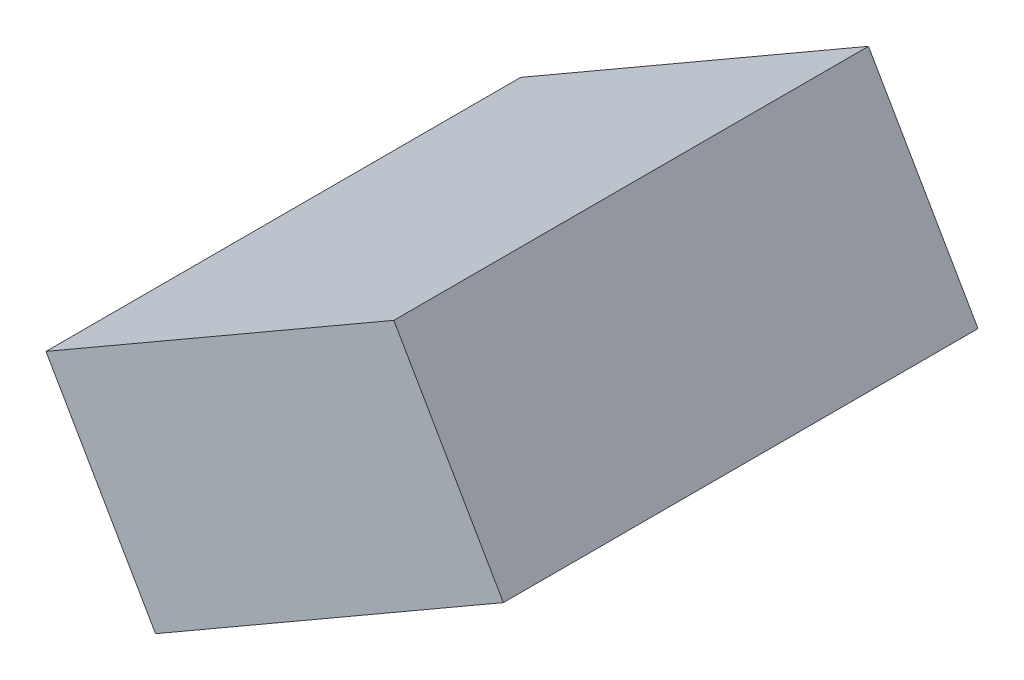
ISO-10303-21;
HEADER;
FILE_DESCRIPTION(('STEP AP214'),'2;1');
FILE_NAME('part.step','',(''),(''),'','','');
FILE_SCHEMA(('AUTOMOTIVE_DESIGN { 1 0 10303 214 1 1 1 1 }'));
ENDSEC;
DATA;
#1=APPLICATION_CONTEXT('core data for automotive mechanical design processes');
#2=APPLICATION_PROTOCOL_DEFINITION('international standard','automotive_design',2000,#1);
#3=PRODUCT_CONTEXT('',#1,'mechanical');
#4=PRODUCT('Part','Part','',(#3));
#5=PRODUCT_RELATED_PRODUCT_CATEGORY('part','',(#4));
#6=PRODUCT_DEFINITION_FORMATION('','',#4);
#7=PRODUCT_DEFINITION_CONTEXT('part definition',#1,'design');
#8=PRODUCT_DEFINITION('design','',#6,#7);
#9=PRODUCT_DEFINITION_SHAPE('','',#8);
#10=(LENGTH_UNIT() NAMED_UNIT(*) SI_UNIT(.MILLI.,.METRE.));
#11=(NAMED_UNIT(*) PLANE_ANGLE_UNIT() SI_UNIT($,.RADIAN.));
#12=(NAMED_UNIT(*) SI_UNIT($,.STERADIAN.) SOLID_ANGLE_UNIT());
#13=UNCERTAINTY_MEASURE_WITH_UNIT(LENGTH_MEASURE(1.E-05),#10,'distance_accuracy_value','');
#14=(GEOMETRIC_REPRESENTATION_CONTEXT(3) GLOBAL_UNCERTAINTY_ASSIGNED_CONTEXT((#13)) GLOBAL_UNIT_ASSIGNED_CONTEXT((#10,
#11,#12)) REPRESENTATION_CONTEXT('',''));
#15=CARTESIAN_POINT('',(0.,0.,0.));
#16=DIRECTION('',(0.,0.,1.));
#17=DIRECTION('',(1.,0.,0.));
#18=AXIS2_PLACEMENT_3D('',#15,#16,#17);
#19=CARTESIAN_POINT('',(-0.32630872,-0.53480462,0.));
#20=DIRECTION('',(-0.499999889580193,0.866025467535334,0.));
#21=DIRECTION('',(-0.866025467535334,-0.499999889580193,0.));
#22=AXIS2_PLACEMENT_3D('',#19,#20,#21);
#23=PLANE('',#22);
#24=DIRECTION('',(0.,0.,1.));
#25=VECTOR('',#24,1.);
#26=CARTESIAN_POINT('',(0.6263132,0.01519173999998,0.));
#27=LINE('',#26,#25);
#28=CARTESIAN_POINT('',(0.626313200000005,0.0151917399999707,0.));
#29=VERTEX_POINT('',#28);
#30=CARTESIAN_POINT('',(0.626313200000005,0.0151917399999707,1.29999994));
#31=VERTEX_POINT('',#30);
#32=EDGE_CURVE('E20',#29,#31,#27,.T.);
#33=ORIENTED_EDGE('',*,*,#32,.T.);
#34=DIRECTION('',(-0.866025467535315,-0.499999889580227,0.));
#35=VECTOR('',#34,1.);
#36=CARTESIAN_POINT('',(0.6263132,0.01519173999998,1.29999994));
#37=LINE('',#36,#35);
#38=CARTESIAN_POINT('',(-0.326308719999959,-0.534804619999976,1.29999994));
#39=VERTEX_POINT('',#38);
#40=EDGE_CURVE('E55',#31,#39,#37,.T.);
#41=ORIENTED_EDGE('',*,*,#40,.T.);
#42=DIRECTION('',(0.,0.,1.));
#43=VECTOR('',#42,1.);
#44=CARTESIAN_POINT('',(-0.326308719999837,-0.534804619999906,0.));
#45=LINE('',#44,#43);
#46=CARTESIAN_POINT('',(-0.326308719999959,-0.534804619999976,0.));
#47=VERTEX_POINT('',#46);
#48=EDGE_CURVE('E76',#39,#47,#45,.F.);
#49=ORIENTED_EDGE('',*,*,#48,.T.);
#50=DIRECTION('',(-0.866025467535315,-0.499999889580227,0.));
#51=VECTOR('',#50,1.);
#52=CARTESIAN_POINT('',(0.6263132,0.01519173999998,0.));
#53=LINE('',#52,#51);
#54=EDGE_CURVE('E58',#29,#47,#53,.T.);
#55=ORIENTED_EDGE('',*,*,#54,.F.);
#56=EDGE_LOOP('',(#33,#41,#49,#55));
#57=FACE_BOUND('',#56,.T.);
#58=ADVANCED_FACE('F17',(#57),#23,.F.);
#59=CARTESIAN_POINT('',(0.6263132,0.01519173999998,0.));
#60=DIRECTION('',(-0.866027743934068,-0.499995946720039,0.));
#61=DIRECTION('',(0.499995946720039,-0.866027743934068,0.));
#62=AXIS2_PLACEMENT_3D('',#59,#60,#61);
#63=PLANE('',#62);
#64=DIRECTION('',(0.,0.,1.));
#65=VECTOR('',#64,1.);
#66=CARTESIAN_POINT('',(0.32631634,0.53480716,0.));
#67=LINE('',#66,#65);
#68=CARTESIAN_POINT('',(0.326316339999941,0.534807159999966,0.));
#69=VERTEX_POINT('',#68);
#70=CARTESIAN_POINT('',(0.326316339999941,0.534807159999966,1.29999994));
#71=VERTEX_POINT('',#70);
#72=EDGE_CURVE('E73',#69,#71,#67,.T.);
#73=ORIENTED_EDGE('',*,*,#72,.T.);
#74=DIRECTION('',(0.499995946719843,-0.866027743934182,0.));
#75=VECTOR('',#74,1.);
#76=CARTESIAN_POINT('',(0.32631634,0.53480716,1.29999994));
#77=LINE('',#76,#75);
#78=EDGE_CURVE('E63',#71,#31,#77,.T.);
#79=ORIENTED_EDGE('',*,*,#78,.T.);
#80=ORIENTED_EDGE('',*,*,#32,.F.);
#81=DIRECTION('',(0.499995946719843,-0.866027743934182,0.));
#82=VECTOR('',#81,1.);
#83=CARTESIAN_POINT('',(0.32631634,0.53480716,0.));
#84=LINE('',#83,#82);
#85=EDGE_CURVE('E78',#69,#29,#84,.T.);
#86=ORIENTED_EDGE('',*,*,#85,.F.);
#87=EDGE_LOOP('',(#73,#79,#80,#86));
#88=FACE_BOUND('',#87,.T.);
#89=ADVANCED_FACE('F72',(#88),#63,.F.);
#90=CARTESIAN_POINT('',(0.32631634,0.53480716,1.29999994));
#91=DIRECTION('',(0.,0.,-1.));
#92=DIRECTION('',(-1.,0.,0.));
#93=AXIS2_PLACEMENT_3D('',#90,#91,#92);
#94=PLANE('',#93);
#95=DIRECTION('',(-0.500002296729118,0.866024077763204,0.));
#96=VECTOR('',#95,1.);
#97=CARTESIAN_POINT('',(-0.62631066,-0.01518920000001,1.29999994));
#98=LINE('',#97,#96);
#99=CARTESIAN_POINT('',(-0.626310660000023,-0.0151891999999696,1.29999994));
#100=VERTEX_POINT('',#99);
#101=EDGE_CURVE('E69',#100,#39,#98,.F.);
#102=ORIENTED_EDGE('',*,*,#101,.T.);
#103=ORIENTED_EDGE('',*,*,#40,.F.);
#104=ORIENTED_EDGE('',*,*,#78,.F.);
#105=DIRECTION('',(0.866026622080792,0.49999788984288,0.));
#106=VECTOR('',#105,1.);
#107=CARTESIAN_POINT('',(0.32631634,0.53480716,1.29999994));
#108=LINE('',#107,#106);
#109=EDGE_CURVE('E83',#71,#100,#108,.F.);
#110=ORIENTED_EDGE('',*,*,#109,.T.);
#111=EDGE_LOOP('',(#102,#103,#104,#110));
#112=FACE_BOUND('',#111,.T.);
#113=ADVANCED_FACE('F66',(#112),#94,.F.);
#114=CARTESIAN_POINT('',(-0.62631066,-0.01518920000001,0.));
#115=DIRECTION('',(0.866024077763204,0.500002296729118,0.));
#116=DIRECTION('',(-0.500002296729118,0.866024077763204,0.));
#117=AXIS2_PLACEMENT_3D('',#114,#115,#116);
#118=PLANE('',#117);
#119=ORIENTED_EDGE('',*,*,#48,.F.);
#120=ORIENTED_EDGE('',*,*,#101,.F.);
#121=DIRECTION('',(0.,0.,1.));
#122=VECTOR('',#121,1.);
#123=CARTESIAN_POINT('',(-0.626310660000093,-0.0151891999998483,0.));
#124=LINE('',#123,#122);
#125=CARTESIAN_POINT('',(-0.626310660000023,-0.0151891999999696,0.));
#126=VERTEX_POINT('',#125);
#127=EDGE_CURVE('E26',#100,#126,#124,.F.);
#128=ORIENTED_EDGE('',*,*,#127,.T.);
#129=DIRECTION('',(-0.500002296728846,0.86602407776336,0.));
#130=VECTOR('',#129,1.);
#131=CARTESIAN_POINT('',(-0.32630872,-0.53480462,0.));
#132=LINE('',#131,#130);
#133=EDGE_CURVE('E34',#47,#126,#132,.T.);
#134=ORIENTED_EDGE('',*,*,#133,.F.);
#135=EDGE_LOOP('',(#119,#120,#128,#134));
#136=FACE_BOUND('',#135,.T.);
#137=ADVANCED_FACE('F88',(#136),#118,.F.);
#138=CARTESIAN_POINT('',(0.32631634,0.53480716,0.));
#139=DIRECTION('',(0.,0.,-1.));
#140=DIRECTION('',(-1.,0.,0.));
#141=AXIS2_PLACEMENT_3D('',#138,#139,#140);
#142=PLANE('',#141);
#143=ORIENTED_EDGE('',*,*,#133,.T.);
#144=DIRECTION('',(0.866026622080792,0.49999788984288,0.));
#145=VECTOR('',#144,1.);
#146=CARTESIAN_POINT('',(0.32631634,0.53480716,0.));
#147=LINE('',#146,#145);
#148=EDGE_CURVE('E11',#126,#69,#147,.T.);
#149=ORIENTED_EDGE('',*,*,#148,.T.);
#150=ORIENTED_EDGE('',*,*,#85,.T.);
#151=ORIENTED_EDGE('',*,*,#54,.T.);
#152=EDGE_LOOP('',(#143,#149,#150,#151));
#153=FACE_BOUND('',#152,.T.);
#154=ADVANCED_FACE('F91',(#153),#142,.T.);
#155=CARTESIAN_POINT('',(0.32631634,0.53480716,0.));
#156=DIRECTION('',(0.49999788984288,-0.866026622080792,0.));
#157=DIRECTION('',(0.866026622080792,0.49999788984288,0.));
#158=AXIS2_PLACEMENT_3D('',#155,#156,#157);
#159=PLANE('',#158);
#160=ORIENTED_EDGE('',*,*,#127,.F.);
#161=ORIENTED_EDGE('',*,*,#109,.F.);
#162=ORIENTED_EDGE('',*,*,#72,.F.);
#163=ORIENTED_EDGE('',*,*,#148,.F.);
#164=EDGE_LOOP('',(#160,#161,#162,#163));
#165=FACE_BOUND('',#164,.T.);
#166=ADVANCED_FACE('F90',(#165),#159,.F.);
#167=CLOSED_SHELL('',(#58,#89,#113,#137,#154,#166));
#168=MANIFOLD_SOLID_BREP('B1',#167);
#169=ADVANCED_BREP_SHAPE_REPRESENTATION('',(#18,#168),#14);
#170=SHAPE_DEFINITION_REPRESENTATION(#9,#169);
ENDSEC;
END-ISO-10303-21;
